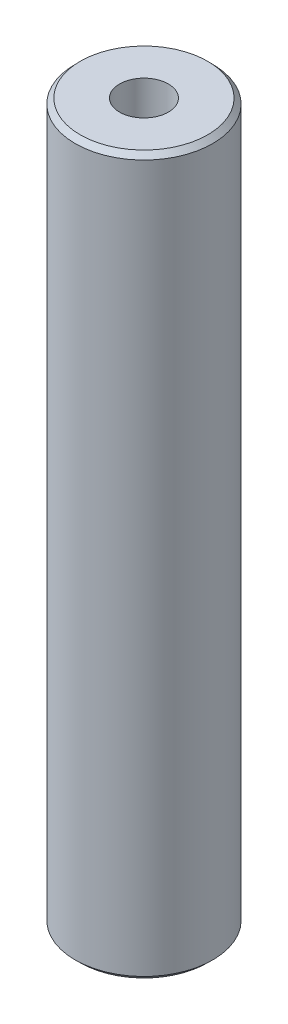
ISO-10303-21;
HEADER;
FILE_DESCRIPTION(('STEP AP214'),'2;1');
FILE_NAME('part.step','',(''),(''),'','','');
FILE_SCHEMA(('AUTOMOTIVE_DESIGN { 1 0 10303 214 1 1 1 1 }'));
ENDSEC;
DATA;
#1=APPLICATION_CONTEXT('core data for automotive mechanical design processes');
#2=APPLICATION_PROTOCOL_DEFINITION('international standard','automotive_design',2000,#1);
#3=PRODUCT_CONTEXT('',#1,'mechanical');
#4=PRODUCT('Part','Part','',(#3));
#5=PRODUCT_RELATED_PRODUCT_CATEGORY('part','',(#4));
#6=PRODUCT_DEFINITION_FORMATION('','',#4);
#7=PRODUCT_DEFINITION_CONTEXT('part definition',#1,'design');
#8=PRODUCT_DEFINITION('design','',#6,#7);
#9=PRODUCT_DEFINITION_SHAPE('','',#8);
#10=(LENGTH_UNIT() NAMED_UNIT(*) SI_UNIT(.MILLI.,.METRE.));
#11=(NAMED_UNIT(*) PLANE_ANGLE_UNIT() SI_UNIT($,.RADIAN.));
#12=(NAMED_UNIT(*) SI_UNIT($,.STERADIAN.) SOLID_ANGLE_UNIT());
#13=UNCERTAINTY_MEASURE_WITH_UNIT(LENGTH_MEASURE(1.E-05),#10,'distance_accuracy_value','');
#14=(GEOMETRIC_REPRESENTATION_CONTEXT(3) GLOBAL_UNCERTAINTY_ASSIGNED_CONTEXT((#13)) GLOBAL_UNIT_ASSIGNED_CONTEXT((#10,
#11,#12)) REPRESENTATION_CONTEXT('',''));
#15=CARTESIAN_POINT('',(0.,0.,0.));
#16=DIRECTION('',(0.,0.,1.));
#17=DIRECTION('',(1.,0.,0.));
#18=AXIS2_PLACEMENT_3D('',#15,#16,#17);
#19=CARTESIAN_POINT('',(0.,600.,0.));
#20=DIRECTION('',(0.,-1.,0.));
#21=DIRECTION('',(0.,0.,-1.));
#22=AXIS2_PLACEMENT_3D('',#19,#20,#21);
#23=CYLINDRICAL_SURFACE('',#22,57.5);
#24=CARTESIAN_POINT('',(0.,595.712050953934,0.));
#25=DIRECTION('',(0.,1.,0.));
#26=DIRECTION('',(0.,0.,1.));
#27=AXIS2_PLACEMENT_3D('',#24,#25,#26);
#28=CIRCLE('',#27,57.5);
#29=CARTESIAN_POINT('',(0.,595.712050953934,57.5));
#30=VERTEX_POINT('',#29);
#31=EDGE_CURVE('E50',#30,#30,#28,.F.);
#32=ORIENTED_EDGE('',*,*,#31,.T.);
#33=EDGE_LOOP('',(#32));
#34=FACE_BOUND('',#33,.T.);
#35=CARTESIAN_POINT('',(0.,4.16794649321406,0.));
#36=DIRECTION('',(0.,1.,0.));
#37=DIRECTION('',(0.,0.,1.));
#38=AXIS2_PLACEMENT_3D('',#35,#36,#37);
#39=CIRCLE('',#38,57.5);
#40=CARTESIAN_POINT('',(0.,4.16794649321406,57.5));
#41=VERTEX_POINT('',#40);
#42=EDGE_CURVE('E51',#41,#41,#39,.T.);
#43=ORIENTED_EDGE('',*,*,#42,.T.);
#44=EDGE_LOOP('',(#43));
#45=FACE_BOUND('',#44,.T.);
#46=ADVANCED_FACE('F39',(#34,#45),#23,.T.);
#47=CARTESIAN_POINT('',(0.,600.,0.));
#48=DIRECTION('',(0.,1.,0.));
#49=DIRECTION('',(0.,0.,1.));
#50=AXIS2_PLACEMENT_3D('',#47,#48,#49);
#51=PLANE('',#50);
#52=CARTESIAN_POINT('',(0.,600.,0.));
#53=DIRECTION('',(0.,1.,0.));
#54=DIRECTION('',(0.,0.,1.));
#55=AXIS2_PLACEMENT_3D('',#52,#53,#54);
#56=CIRCLE('',#55,53.332053506786);
#57=CARTESIAN_POINT('',(0.,600.,53.332053506786));
#58=VERTEX_POINT('',#57);
#59=EDGE_CURVE('E54',#58,#58,#56,.T.);
#60=ORIENTED_EDGE('',*,*,#59,.T.);
#61=EDGE_LOOP('',(#60));
#62=FACE_BOUND('',#61,.T.);
#63=CARTESIAN_POINT('',(0.,600.,0.));
#64=DIRECTION('',(0.,1.,0.));
#65=DIRECTION('',(0.,0.,1.));
#66=AXIS2_PLACEMENT_3D('',#63,#64,#65);
#67=CIRCLE('',#66,20.4307585706887);
#68=CARTESIAN_POINT('',(0.,600.,20.4307585706887));
#69=VERTEX_POINT('',#68);
#70=EDGE_CURVE('E58',#69,#69,#67,.T.);
#71=ORIENTED_EDGE('',*,*,#70,.F.);
#72=EDGE_LOOP('',(#71));
#73=FACE_BOUND('',#72,.T.);
#74=ADVANCED_FACE('F69',(#62,#73),#51,.T.);
#75=CARTESIAN_POINT('',(0.,0.,0.));
#76=DIRECTION('',(0.,1.,0.));
#77=DIRECTION('',(0.,0.,1.));
#78=AXIS2_PLACEMENT_3D('',#75,#76,#77);
#79=PLANE('',#78);
#80=CARTESIAN_POINT('',(0.,0.,0.));
#81=DIRECTION('',(0.,1.,0.));
#82=DIRECTION('',(0.,0.,1.));
#83=AXIS2_PLACEMENT_3D('',#80,#81,#82);
#84=CIRCLE('',#83,53.2120509539341);
#85=CARTESIAN_POINT('',(0.,0.,53.2120509539341));
#86=VERTEX_POINT('',#85);
#87=EDGE_CURVE('E10',#86,#86,#84,.F.);
#88=ORIENTED_EDGE('',*,*,#87,.T.);
#89=EDGE_LOOP('',(#88));
#90=FACE_BOUND('',#89,.T.);
#91=CARTESIAN_POINT('',(0.,0.,0.));
#92=DIRECTION('',(0.,1.,0.));
#93=DIRECTION('',(0.,0.,1.));
#94=AXIS2_PLACEMENT_3D('',#91,#92,#93);
#95=CIRCLE('',#94,20.4307585706887);
#96=CARTESIAN_POINT('',(0.,0.,20.4307585706887));
#97=VERTEX_POINT('',#96);
#98=EDGE_CURVE('E63',#97,#97,#95,.T.);
#99=ORIENTED_EDGE('',*,*,#98,.T.);
#100=EDGE_LOOP('',(#99));
#101=FACE_BOUND('',#100,.T.);
#102=ADVANCED_FACE('F75',(#90,#101),#79,.F.);
#103=CARTESIAN_POINT('',(0.,600.,0.));
#104=DIRECTION('',(0.,-1.,0.));
#105=DIRECTION('',(0.,0.,-1.));
#106=AXIS2_PLACEMENT_3D('',#103,#104,#105);
#107=CYLINDRICAL_SURFACE('',#106,20.4307585706887);
#108=ORIENTED_EDGE('',*,*,#70,.T.);
#109=EDGE_LOOP('',(#108));
#110=FACE_BOUND('',#109,.T.);
#111=ORIENTED_EDGE('',*,*,#98,.F.);
#112=EDGE_LOOP('',(#111));
#113=FACE_BOUND('',#112,.T.);
#114=ADVANCED_FACE('F70',(#110,#113),#107,.F.);
#115=CARTESIAN_POINT('',(0.,600.,0.));
#116=DIRECTION('',(0.,-1.,0.));
#117=DIRECTION('',(0.,0.,-1.));
#118=AXIS2_PLACEMENT_3D('',#115,#116,#117);
#119=CONICAL_SURFACE('',#118,53.332053506786,0.771207531896146);
#120=ORIENTED_EDGE('',*,*,#31,.F.);
#121=EDGE_LOOP('',(#120));
#122=FACE_BOUND('',#121,.T.);
#123=ORIENTED_EDGE('',*,*,#59,.F.);
#124=EDGE_LOOP('',(#123));
#125=FACE_BOUND('',#124,.T.);
#126=ADVANCED_FACE('F81',(#122,#125),#119,.T.);
#127=CARTESIAN_POINT('',(0.,4.16794649321406,0.));
#128=DIRECTION('',(0.,1.,0.));
#129=DIRECTION('',(0.,0.,1.));
#130=AXIS2_PLACEMENT_3D('',#127,#128,#129);
#131=CONICAL_SURFACE('',#130,57.5,0.799588794898753);
#132=ORIENTED_EDGE('',*,*,#87,.F.);
#133=EDGE_LOOP('',(#132));
#134=FACE_BOUND('',#133,.T.);
#135=ORIENTED_EDGE('',*,*,#42,.F.);
#136=EDGE_LOOP('',(#135));
#137=FACE_BOUND('',#136,.T.);
#138=ADVANCED_FACE('F45',(#134,#137),#131,.T.);
#139=CLOSED_SHELL('',(#46,#74,#102,#114,#126,#138));
#140=MANIFOLD_SOLID_BREP('B2',#139);
#141=ADVANCED_BREP_SHAPE_REPRESENTATION('',(#18,#140),#14);
#142=SHAPE_DEFINITION_REPRESENTATION(#9,#141);
ENDSEC;
END-ISO-10303-21;
